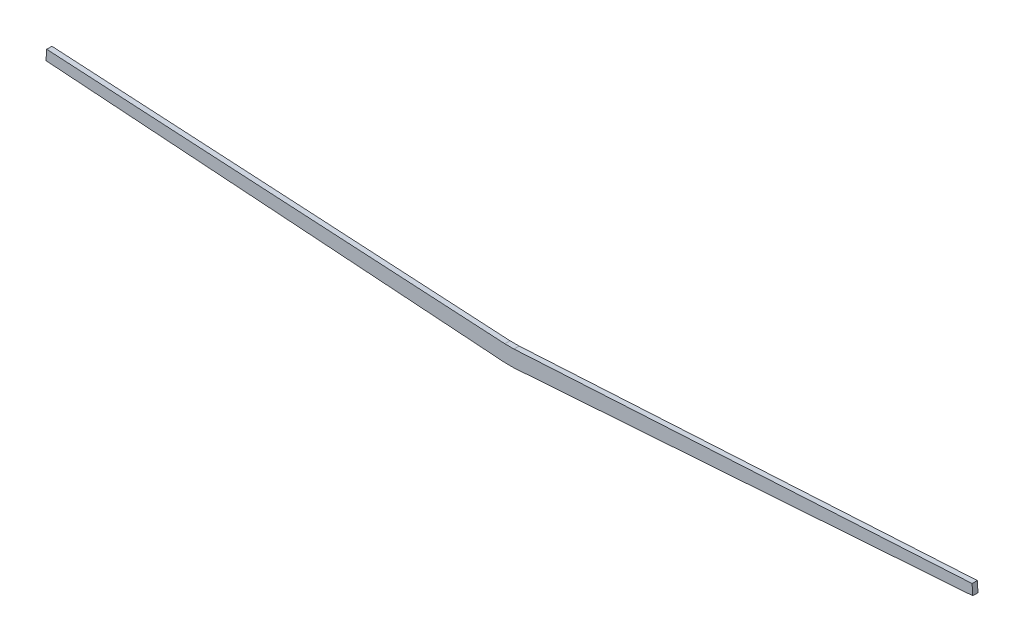
ISO-10303-21;
HEADER;
FILE_DESCRIPTION(('STEP AP214'),'2;1');
FILE_NAME('part.step','',(''),(''),'','','');
FILE_SCHEMA(('AUTOMOTIVE_DESIGN { 1 0 10303 214 1 1 1 1 }'));
ENDSEC;
DATA;
#1=APPLICATION_CONTEXT('core data for automotive mechanical design processes');
#2=APPLICATION_PROTOCOL_DEFINITION('international standard','automotive_design',2000,#1);
#3=PRODUCT_CONTEXT('',#1,'mechanical');
#4=PRODUCT('Part','Part','',(#3));
#5=PRODUCT_RELATED_PRODUCT_CATEGORY('part','',(#4));
#6=PRODUCT_DEFINITION_FORMATION('','',#4);
#7=PRODUCT_DEFINITION_CONTEXT('part definition',#1,'design');
#8=PRODUCT_DEFINITION('design','',#6,#7);
#9=PRODUCT_DEFINITION_SHAPE('','',#8);
#10=(LENGTH_UNIT() NAMED_UNIT(*) SI_UNIT(.MILLI.,.METRE.));
#11=(NAMED_UNIT(*) PLANE_ANGLE_UNIT() SI_UNIT($,.RADIAN.));
#12=(NAMED_UNIT(*) SI_UNIT($,.STERADIAN.) SOLID_ANGLE_UNIT());
#13=UNCERTAINTY_MEASURE_WITH_UNIT(LENGTH_MEASURE(1.E-05),#10,'distance_accuracy_value','');
#14=(GEOMETRIC_REPRESENTATION_CONTEXT(3) GLOBAL_UNCERTAINTY_ASSIGNED_CONTEXT((#13)) GLOBAL_UNIT_ASSIGNED_CONTEXT((#10,
#11,#12)) REPRESENTATION_CONTEXT('',''));
#15=CARTESIAN_POINT('',(0.,0.,0.));
#16=DIRECTION('',(0.,0.,1.));
#17=DIRECTION('',(1.,0.,0.));
#18=AXIS2_PLACEMENT_3D('',#15,#16,#17);
#19=CARTESIAN_POINT('',(-640.329563343606,58.5909032602639,7.2));
#20=DIRECTION('',(0.997564050259824,-0.0697564737441235,0.));
#21=DIRECTION('',(0.0697564737441235,0.997564050259824,0.));
#22=AXIS2_PLACEMENT_3D('',#19,#20,#21);
#23=PLANE('',#22);
#24=DIRECTION('',(-0.0697564737441235,-0.997564050259824,0.));
#25=VECTOR('',#24,1.);
#26=CARTESIAN_POINT('',(-640.329563343606,58.5909032602639,0.));
#27=LINE('',#26,#25);
#28=CARTESIAN_POINT('',(-640.329563343606,58.5909032602639,0.));
#29=VERTEX_POINT('',#28);
#30=CARTESIAN_POINT('',(-641.321779426143,44.4015522093681,0.));
#31=VERTEX_POINT('',#30);
#32=EDGE_CURVE('E131',#29,#31,#27,.T.);
#33=ORIENTED_EDGE('',*,*,#32,.T.);
#34=DIRECTION('',(0.,0.,-1.));
#35=VECTOR('',#34,1.);
#36=CARTESIAN_POINT('',(-641.321779426143,44.4015522093681,7.2));
#37=LINE('',#36,#35);
#38=CARTESIAN_POINT('',(-641.321779426143,44.4015522093681,7.2));
#39=VERTEX_POINT('',#38);
#40=EDGE_CURVE('E11',#39,#31,#37,.T.);
#41=ORIENTED_EDGE('',*,*,#40,.F.);
#42=DIRECTION('',(-0.0697564737441235,-0.997564050259824,0.));
#43=VECTOR('',#42,1.);
#44=CARTESIAN_POINT('',(-640.329563343606,58.5909032602639,7.2));
#45=LINE('',#44,#43);
#46=CARTESIAN_POINT('',(-640.329563343606,58.5909032602639,7.2));
#47=VERTEX_POINT('',#46);
#48=EDGE_CURVE('E145',#47,#39,#45,.T.);
#49=ORIENTED_EDGE('',*,*,#48,.F.);
#50=DIRECTION('',(0.,0.,-1.));
#51=VECTOR('',#50,1.);
#52=CARTESIAN_POINT('',(-640.329563343606,58.5909032602639,7.2));
#53=LINE('',#52,#51);
#54=EDGE_CURVE('E127',#47,#29,#53,.T.);
#55=ORIENTED_EDGE('',*,*,#54,.T.);
#56=EDGE_LOOP('',(#33,#41,#49,#55));
#57=FACE_BOUND('',#56,.T.);
#58=ADVANCED_FACE('F35',(#57),#23,.F.);
#59=CARTESIAN_POINT('',(-641.321779426143,44.4015522093681,7.2));
#60=DIRECTION('',(0.0697564737441255,0.997564050259824,0.));
#61=DIRECTION('',(-0.997564050259824,0.0697564737441255,0.));
#62=AXIS2_PLACEMENT_3D('',#59,#60,#61);
#63=PLANE('',#62);
#64=DIRECTION('',(0.997564050259824,-0.0697564737441255,0.));
#65=VECTOR('',#64,1.);
#66=CARTESIAN_POINT('',(-641.321779426143,44.4015522093681,0.));
#67=LINE('',#66,#65);
#68=CARTESIAN_POINT('',(-6.35,0.,0.));
#69=VERTEX_POINT('',#68);
#70=EDGE_CURVE('E134',#31,#69,#67,.T.);
#71=ORIENTED_EDGE('',*,*,#70,.T.);
#72=DIRECTION('',(0.,0.,-1.));
#73=VECTOR('',#72,1.);
#74=CARTESIAN_POINT('',(-6.35,0.,7.2));
#75=LINE('',#74,#73);
#76=CARTESIAN_POINT('',(-6.35,0.,7.2));
#77=VERTEX_POINT('',#76);
#78=EDGE_CURVE('E43',#77,#69,#75,.T.);
#79=ORIENTED_EDGE('',*,*,#78,.F.);
#80=DIRECTION('',(0.997564050259824,-0.0697564737441255,0.));
#81=VECTOR('',#80,1.);
#82=CARTESIAN_POINT('',(-641.321779426143,44.4015522093681,7.2));
#83=LINE('',#82,#81);
#84=EDGE_CURVE('E94',#39,#77,#83,.T.);
#85=ORIENTED_EDGE('',*,*,#84,.F.);
#86=ORIENTED_EDGE('',*,*,#40,.T.);
#87=EDGE_LOOP('',(#71,#79,#85,#86));
#88=FACE_BOUND('',#87,.T.);
#89=ADVANCED_FACE('F180',(#88),#63,.F.);
#90=CARTESIAN_POINT('',(-6.35,0.,7.2));
#91=DIRECTION('',(0.,1.,0.));
#92=DIRECTION('',(0.,0.,1.));
#93=AXIS2_PLACEMENT_3D('',#90,#91,#92);
#94=PLANE('',#93);
#95=DIRECTION('',(1.,0.,0.));
#96=VECTOR('',#95,1.);
#97=CARTESIAN_POINT('',(-6.35,0.,0.));
#98=LINE('',#97,#96);
#99=CARTESIAN_POINT('',(6.35,0.,0.));
#100=VERTEX_POINT('',#99);
#101=EDGE_CURVE('E136',#69,#100,#98,.T.);
#102=ORIENTED_EDGE('',*,*,#101,.T.);
#103=DIRECTION('',(0.,0.,-1.));
#104=VECTOR('',#103,1.);
#105=CARTESIAN_POINT('',(6.35,0.,7.2));
#106=LINE('',#105,#104);
#107=CARTESIAN_POINT('',(6.35,0.,7.2));
#108=VERTEX_POINT('',#107);
#109=EDGE_CURVE('E152',#108,#100,#106,.T.);
#110=ORIENTED_EDGE('',*,*,#109,.F.);
#111=DIRECTION('',(1.,0.,0.));
#112=VECTOR('',#111,1.);
#113=CARTESIAN_POINT('',(-6.35,0.,7.2));
#114=LINE('',#113,#112);
#115=EDGE_CURVE('E160',#77,#108,#114,.T.);
#116=ORIENTED_EDGE('',*,*,#115,.F.);
#117=ORIENTED_EDGE('',*,*,#78,.T.);
#118=EDGE_LOOP('',(#102,#110,#116,#117));
#119=FACE_BOUND('',#118,.T.);
#120=ADVANCED_FACE('F158',(#119),#94,.F.);
#121=CARTESIAN_POINT('',(6.35,0.,7.2));
#122=DIRECTION('',(-0.0697564737441255,0.997564050259824,0.));
#123=DIRECTION('',(-0.997564050259824,-0.0697564737441255,0.));
#124=AXIS2_PLACEMENT_3D('',#121,#122,#123);
#125=PLANE('',#124);
#126=DIRECTION('',(0.997564050259824,0.0697564737441255,0.));
#127=VECTOR('',#126,1.);
#128=CARTESIAN_POINT('',(6.35,0.,0.));
#129=LINE('',#128,#127);
#130=CARTESIAN_POINT('',(641.321779426143,44.4015522093681,0.));
#131=VERTEX_POINT('',#130);
#132=EDGE_CURVE('E138',#100,#131,#129,.T.);
#133=ORIENTED_EDGE('',*,*,#132,.T.);
#134=DIRECTION('',(0.,0.,-1.));
#135=VECTOR('',#134,1.);
#136=CARTESIAN_POINT('',(641.321779426143,44.4015522093681,7.2));
#137=LINE('',#136,#135);
#138=CARTESIAN_POINT('',(641.321779426143,44.4015522093681,7.2));
#139=VERTEX_POINT('',#138);
#140=EDGE_CURVE('E149',#139,#131,#137,.T.);
#141=ORIENTED_EDGE('',*,*,#140,.F.);
#142=DIRECTION('',(0.997564050259824,0.0697564737441255,0.));
#143=VECTOR('',#142,1.);
#144=CARTESIAN_POINT('',(6.35,0.,7.2));
#145=LINE('',#144,#143);
#146=EDGE_CURVE('E172',#108,#139,#145,.T.);
#147=ORIENTED_EDGE('',*,*,#146,.F.);
#148=ORIENTED_EDGE('',*,*,#109,.T.);
#149=EDGE_LOOP('',(#133,#141,#147,#148));
#150=FACE_BOUND('',#149,.T.);
#151=ADVANCED_FACE('F168',(#150),#125,.F.);
#152=CARTESIAN_POINT('',(641.321779426143,44.4015522093681,7.2));
#153=DIRECTION('',(-0.997564050259824,-0.0697564737441235,0.));
#154=DIRECTION('',(0.0697564737441235,-0.997564050259824,0.));
#155=AXIS2_PLACEMENT_3D('',#152,#153,#154);
#156=PLANE('',#155);
#157=DIRECTION('',(-0.0697564737441235,0.997564050259824,0.));
#158=VECTOR('',#157,1.);
#159=CARTESIAN_POINT('',(641.321779426143,44.4015522093681,0.));
#160=LINE('',#159,#158);
#161=CARTESIAN_POINT('',(640.329563343606,58.5909032602639,0.));
#162=VERTEX_POINT('',#161);
#163=EDGE_CURVE('E140',#131,#162,#160,.T.);
#164=ORIENTED_EDGE('',*,*,#163,.T.);
#165=DIRECTION('',(0.,0.,-1.));
#166=VECTOR('',#165,1.);
#167=CARTESIAN_POINT('',(640.329563343606,58.5909032602639,7.2));
#168=LINE('',#167,#166);
#169=CARTESIAN_POINT('',(640.329563343606,58.5909032602639,7.2));
#170=VERTEX_POINT('',#169);
#171=EDGE_CURVE('E122',#170,#162,#168,.T.);
#172=ORIENTED_EDGE('',*,*,#171,.F.);
#173=DIRECTION('',(-0.0697564737441235,0.997564050259824,0.));
#174=VECTOR('',#173,1.);
#175=CARTESIAN_POINT('',(641.321779426143,44.4015522093681,7.2));
#176=LINE('',#175,#174);
#177=EDGE_CURVE('E113',#139,#170,#176,.T.);
#178=ORIENTED_EDGE('',*,*,#177,.F.);
#179=ORIENTED_EDGE('',*,*,#140,.T.);
#180=EDGE_LOOP('',(#164,#172,#178,#179));
#181=FACE_BOUND('',#180,.T.);
#182=ADVANCED_FACE('F171',(#181),#156,.F.);
#183=CARTESIAN_POINT('',(640.329563343606,58.5909032602639,7.2));
#184=DIRECTION('',(0.0566691389925415,-0.998393013139537,0.));
#185=DIRECTION('',(0.998393013139537,0.0566691389925416,0.));
#186=AXIS2_PLACEMENT_3D('',#183,#184,#185);
#187=PLANE('',#186);
#188=DIRECTION('',(-0.998393013139537,-0.0566691389925415,0.));
#189=VECTOR('',#188,1.);
#190=CARTESIAN_POINT('',(640.329563343606,58.5909032602639,0.));
#191=LINE('',#190,#189);
#192=CARTESIAN_POINT('',(6.35,22.606,0.));
#193=VERTEX_POINT('',#192);
#194=EDGE_CURVE('E121',#162,#193,#191,.T.);
#195=ORIENTED_EDGE('',*,*,#194,.T.);
#196=DIRECTION('',(0.,0.,-1.));
#197=VECTOR('',#196,1.);
#198=CARTESIAN_POINT('',(6.35,22.606,7.2));
#199=LINE('',#198,#197);
#200=CARTESIAN_POINT('',(6.35,22.606,7.2));
#201=VERTEX_POINT('',#200);
#202=EDGE_CURVE('E118',#201,#193,#199,.T.);
#203=ORIENTED_EDGE('',*,*,#202,.F.);
#204=DIRECTION('',(-0.998393013139537,-0.0566691389925415,0.));
#205=VECTOR('',#204,1.);
#206=CARTESIAN_POINT('',(640.329563343606,58.5909032602639,7.2));
#207=LINE('',#206,#205);
#208=EDGE_CURVE('E107',#170,#201,#207,.T.);
#209=ORIENTED_EDGE('',*,*,#208,.F.);
#210=ORIENTED_EDGE('',*,*,#171,.T.);
#211=EDGE_LOOP('',(#195,#203,#209,#210));
#212=FACE_BOUND('',#211,.T.);
#213=ADVANCED_FACE('F119',(#212),#187,.F.);
#214=CARTESIAN_POINT('',(6.35,22.606,7.2));
#215=DIRECTION('',(0.,-1.,0.));
#216=DIRECTION('',(0.,0.,-1.));
#217=AXIS2_PLACEMENT_3D('',#214,#215,#216);
#218=PLANE('',#217);
#219=DIRECTION('',(-1.,0.,0.));
#220=VECTOR('',#219,1.);
#221=CARTESIAN_POINT('',(6.35,22.606,0.));
#222=LINE('',#221,#220);
#223=CARTESIAN_POINT('',(-6.35,22.606,0.));
#224=VERTEX_POINT('',#223);
#225=EDGE_CURVE('E80',#193,#224,#222,.T.);
#226=ORIENTED_EDGE('',*,*,#225,.T.);
#227=DIRECTION('',(0.,0.,-1.));
#228=VECTOR('',#227,1.);
#229=CARTESIAN_POINT('',(-6.35,22.606,7.2));
#230=LINE('',#229,#228);
#231=CARTESIAN_POINT('',(-6.35,22.606,7.2));
#232=VERTEX_POINT('',#231);
#233=EDGE_CURVE('E123',#232,#224,#230,.T.);
#234=ORIENTED_EDGE('',*,*,#233,.F.);
#235=DIRECTION('',(-1.,0.,0.));
#236=VECTOR('',#235,1.);
#237=CARTESIAN_POINT('',(6.35,22.606,7.2));
#238=LINE('',#237,#236);
#239=EDGE_CURVE('E111',#201,#232,#238,.T.);
#240=ORIENTED_EDGE('',*,*,#239,.F.);
#241=ORIENTED_EDGE('',*,*,#202,.T.);
#242=EDGE_LOOP('',(#226,#234,#240,#241));
#243=FACE_BOUND('',#242,.T.);
#244=ADVANCED_FACE('F125',(#243),#218,.F.);
#245=CARTESIAN_POINT('',(-6.35,22.606,7.2));
#246=DIRECTION('',(-0.0566691389925415,-0.998393013139537,0.));
#247=DIRECTION('',(0.998393013139537,-0.0566691389925416,0.));
#248=AXIS2_PLACEMENT_3D('',#245,#246,#247);
#249=PLANE('',#248);
#250=DIRECTION('',(-0.998393013139537,0.0566691389925415,0.));
#251=VECTOR('',#250,1.);
#252=CARTESIAN_POINT('',(-6.35,22.606,0.));
#253=LINE('',#252,#251);
#254=EDGE_CURVE('E86',#224,#29,#253,.T.);
#255=ORIENTED_EDGE('',*,*,#254,.T.);
#256=ORIENTED_EDGE('',*,*,#54,.F.);
#257=DIRECTION('',(-0.998393013139537,0.0566691389925415,0.));
#258=VECTOR('',#257,1.);
#259=CARTESIAN_POINT('',(-6.35,22.606,7.2));
#260=LINE('',#259,#258);
#261=EDGE_CURVE('E51',#232,#47,#260,.T.);
#262=ORIENTED_EDGE('',*,*,#261,.F.);
#263=ORIENTED_EDGE('',*,*,#233,.T.);
#264=EDGE_LOOP('',(#255,#256,#262,#263));
#265=FACE_BOUND('',#264,.T.);
#266=ADVANCED_FACE('F196',(#265),#249,.F.);
#267=CARTESIAN_POINT('',(0.,0.,7.2));
#268=DIRECTION('',(0.,0.,1.));
#269=DIRECTION('',(1.,0.,0.));
#270=AXIS2_PLACEMENT_3D('',#267,#268,#269);
#271=PLANE('',#270);
#272=ORIENTED_EDGE('',*,*,#48,.T.);
#273=ORIENTED_EDGE('',*,*,#84,.T.);
#274=ORIENTED_EDGE('',*,*,#115,.T.);
#275=ORIENTED_EDGE('',*,*,#146,.T.);
#276=ORIENTED_EDGE('',*,*,#177,.T.);
#277=ORIENTED_EDGE('',*,*,#208,.T.);
#278=ORIENTED_EDGE('',*,*,#239,.T.);
#279=ORIENTED_EDGE('',*,*,#261,.T.);
#280=EDGE_LOOP('',(#272,#273,#274,#275,#276,#277,#278,#279));
#281=FACE_BOUND('',#280,.T.);
#282=ADVANCED_FACE('F109',(#281),#271,.T.);
#283=CARTESIAN_POINT('',(0.,0.,0.));
#284=DIRECTION('',(0.,0.,1.));
#285=DIRECTION('',(1.,0.,0.));
#286=AXIS2_PLACEMENT_3D('',#283,#284,#285);
#287=PLANE('',#286);
#288=ORIENTED_EDGE('',*,*,#32,.F.);
#289=ORIENTED_EDGE('',*,*,#254,.F.);
#290=ORIENTED_EDGE('',*,*,#225,.F.);
#291=ORIENTED_EDGE('',*,*,#194,.F.);
#292=ORIENTED_EDGE('',*,*,#163,.F.);
#293=ORIENTED_EDGE('',*,*,#132,.F.);
#294=ORIENTED_EDGE('',*,*,#101,.F.);
#295=ORIENTED_EDGE('',*,*,#70,.F.);
#296=EDGE_LOOP('',(#288,#289,#290,#291,#292,#293,#294,#295));
#297=FACE_BOUND('',#296,.T.);
#298=ADVANCED_FACE('F164',(#297),#287,.F.);
#299=CLOSED_SHELL('',(#58,#89,#120,#151,#182,#213,#244,#266,#282,#298));
#300=MANIFOLD_SOLID_BREP('B2',#299);
#301=ADVANCED_BREP_SHAPE_REPRESENTATION('',(#18,#300),#14);
#302=SHAPE_DEFINITION_REPRESENTATION(#9,#301);
ENDSEC;
END-ISO-10303-21;
